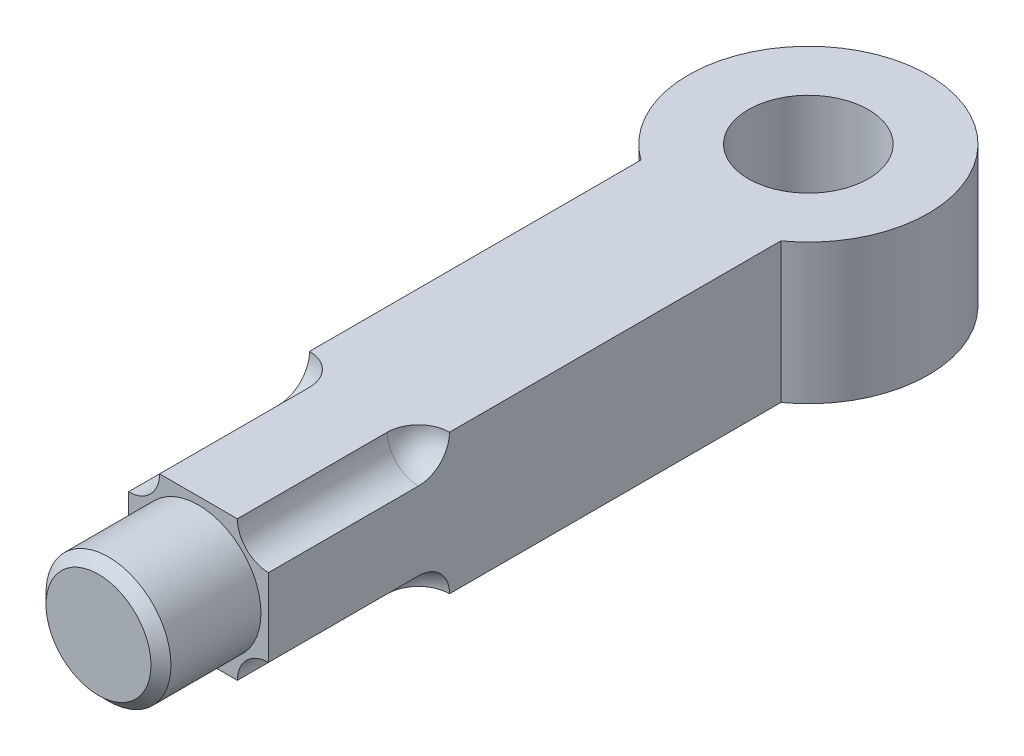
ISO-10303-21;
HEADER;
FILE_DESCRIPTION(('STEP AP214'),'2;1');
FILE_NAME('part.step','',(''),(''),'','','');
FILE_SCHEMA(('AUTOMOTIVE_DESIGN { 1 0 10303 214 1 1 1 1 }'));
ENDSEC;
DATA;
#1=APPLICATION_CONTEXT('core data for automotive mechanical design processes');
#2=APPLICATION_PROTOCOL_DEFINITION('international standard','automotive_design',2000,#1);
#3=PRODUCT_CONTEXT('',#1,'mechanical');
#4=PRODUCT('Part','Part','',(#3));
#5=PRODUCT_RELATED_PRODUCT_CATEGORY('part','',(#4));
#6=PRODUCT_DEFINITION_FORMATION('','',#4);
#7=PRODUCT_DEFINITION_CONTEXT('part definition',#1,'design');
#8=PRODUCT_DEFINITION('design','',#6,#7);
#9=PRODUCT_DEFINITION_SHAPE('','',#8);
#10=(LENGTH_UNIT() NAMED_UNIT(*) SI_UNIT(.MILLI.,.METRE.));
#11=(NAMED_UNIT(*) PLANE_ANGLE_UNIT() SI_UNIT($,.RADIAN.));
#12=(NAMED_UNIT(*) SI_UNIT($,.STERADIAN.) SOLID_ANGLE_UNIT());
#13=UNCERTAINTY_MEASURE_WITH_UNIT(LENGTH_MEASURE(1.E-05),#10,'distance_accuracy_value','');
#14=(GEOMETRIC_REPRESENTATION_CONTEXT(3) GLOBAL_UNCERTAINTY_ASSIGNED_CONTEXT((#13)) GLOBAL_UNIT_ASSIGNED_CONTEXT((#10,
#11,#12)) REPRESENTATION_CONTEXT('',''));
#15=CARTESIAN_POINT('',(0.,0.,0.));
#16=DIRECTION('',(0.,0.,1.));
#17=DIRECTION('',(1.,0.,0.));
#18=AXIS2_PLACEMENT_3D('',#15,#16,#17);
#19=CARTESIAN_POINT('',(0.,0.,122.));
#20=DIRECTION('',(0.,0.,1.));
#21=DIRECTION('',(1.,0.,0.));
#22=AXIS2_PLACEMENT_3D('',#19,#20,#21);
#23=PLANE('',#22);
#24=DIRECTION('',(0.,-1.,0.));
#25=VECTOR('',#24,1.);
#26=CARTESIAN_POINT('',(-14.,-14.,122.));
#27=LINE('',#26,#25);
#28=CARTESIAN_POINT('',(-14.,7.78,122.));
#29=VERTEX_POINT('',#28);
#30=CARTESIAN_POINT('',(-14.,-7.78,122.));
#31=VERTEX_POINT('',#30);
#32=EDGE_CURVE('E184',#29,#31,#27,.T.);
#33=ORIENTED_EDGE('',*,*,#32,.T.);
#34=CARTESIAN_POINT('',(-14.,-14.,122.));
#35=DIRECTION('',(0.,0.,-1.));
#36=DIRECTION('',(0.,-1.,0.));
#37=AXIS2_PLACEMENT_3D('',#34,#35,#36);
#38=CIRCLE('',#37,6.22000000000001);
#39=CARTESIAN_POINT('',(-7.77999999999999,-14.,122.));
#40=VERTEX_POINT('',#39);
#41=EDGE_CURVE('E129',#31,#40,#38,.T.);
#42=ORIENTED_EDGE('',*,*,#41,.T.);
#43=DIRECTION('',(1.,0.,0.));
#44=VECTOR('',#43,1.);
#45=CARTESIAN_POINT('',(14.,-14.,122.));
#46=LINE('',#45,#44);
#47=CARTESIAN_POINT('',(7.77999999999999,-14.,122.));
#48=VERTEX_POINT('',#47);
#49=EDGE_CURVE('E141',#40,#48,#46,.T.);
#50=ORIENTED_EDGE('',*,*,#49,.T.);
#51=CARTESIAN_POINT('',(14.,-14.,122.));
#52=DIRECTION('',(0.,0.,1.));
#53=DIRECTION('',(0.,-1.,0.));
#54=AXIS2_PLACEMENT_3D('',#51,#52,#53);
#55=CIRCLE('',#54,6.22000000000001);
#56=CARTESIAN_POINT('',(14.,-7.78,122.));
#57=VERTEX_POINT('',#56);
#58=EDGE_CURVE('E143',#57,#48,#55,.T.);
#59=ORIENTED_EDGE('',*,*,#58,.F.);
#60=DIRECTION('',(0.,1.,0.));
#61=VECTOR('',#60,1.);
#62=CARTESIAN_POINT('',(14.,-14.,122.));
#63=LINE('',#62,#61);
#64=CARTESIAN_POINT('',(14.,7.78,122.));
#65=VERTEX_POINT('',#64);
#66=EDGE_CURVE('E190',#57,#65,#63,.T.);
#67=ORIENTED_EDGE('',*,*,#66,.T.);
#68=CARTESIAN_POINT('',(14.,14.,122.));
#69=DIRECTION('',(0.,0.,-1.));
#70=DIRECTION('',(0.,1.,0.));
#71=AXIS2_PLACEMENT_3D('',#68,#69,#70);
#72=CIRCLE('',#71,6.22000000000001);
#73=CARTESIAN_POINT('',(7.77999999999999,14.,122.));
#74=VERTEX_POINT('',#73);
#75=EDGE_CURVE('E169',#65,#74,#72,.T.);
#76=ORIENTED_EDGE('',*,*,#75,.T.);
#77=DIRECTION('',(-1.,0.,0.));
#78=VECTOR('',#77,1.);
#79=CARTESIAN_POINT('',(14.,14.,122.));
#80=LINE('',#79,#78);
#81=CARTESIAN_POINT('',(-7.77999999999999,14.,122.));
#82=VERTEX_POINT('',#81);
#83=EDGE_CURVE('E188',#74,#82,#80,.T.);
#84=ORIENTED_EDGE('',*,*,#83,.T.);
#85=CARTESIAN_POINT('',(-14.,14.,122.));
#86=DIRECTION('',(0.,0.,1.));
#87=DIRECTION('',(0.,1.,0.));
#88=AXIS2_PLACEMENT_3D('',#85,#86,#87);
#89=CIRCLE('',#88,6.22000000000001);
#90=EDGE_CURVE('E158',#29,#82,#89,.T.);
#91=ORIENTED_EDGE('',*,*,#90,.F.);
#92=EDGE_LOOP('',(#33,#42,#50,#59,#67,#76,#84,#91));
#93=FACE_BOUND('',#92,.T.);
#94=CARTESIAN_POINT('',(0.,0.,122.));
#95=DIRECTION('',(0.,0.,1.));
#96=DIRECTION('',(1.,0.,0.));
#97=AXIS2_PLACEMENT_3D('',#94,#95,#96);
#98=CIRCLE('',#97,12.5);
#99=CARTESIAN_POINT('',(12.5,0.,122.));
#100=VERTEX_POINT('',#99);
#101=EDGE_CURVE('E136',#100,#100,#98,.T.);
#102=ORIENTED_EDGE('',*,*,#101,.F.);
#103=EDGE_LOOP('',(#102));
#104=FACE_BOUND('',#103,.T.);
#105=ADVANCED_FACE('F33',(#93,#104),#23,.T.);
#106=CARTESIAN_POINT('',(0.,-14.,0.));
#107=DIRECTION('',(0.,1.,0.));
#108=DIRECTION('',(0.,0.,1.));
#109=AXIS2_PLACEMENT_3D('',#106,#107,#108);
#110=PLANE('',#109);
#111=CARTESIAN_POINT('',(0.,-14.,0.));
#112=DIRECTION('',(0.,1.,0.));
#113=DIRECTION('',(0.,0.,1.));
#114=AXIS2_PLACEMENT_3D('',#111,#112,#113);
#115=CIRCLE('',#114,12.);
#116=CARTESIAN_POINT('',(0.,-14.,12.));
#117=VERTEX_POINT('',#116);
#118=EDGE_CURVE('E187',#117,#117,#115,.T.);
#119=ORIENTED_EDGE('',*,*,#118,.T.);
#120=EDGE_LOOP('',(#119));
#121=FACE_BOUND('',#120,.T.);
#122=DIRECTION('',(0.,0.,-1.));
#123=VECTOR('',#122,1.);
#124=CARTESIAN_POINT('',(-7.77999999999999,-14.,19.4935886896179));
#125=LINE('',#124,#123);
#126=CARTESIAN_POINT('',(-7.77999999999997,-14.,92.));
#127=VERTEX_POINT('',#126);
#128=EDGE_CURVE('E128',#127,#40,#125,.F.);
#129=ORIENTED_EDGE('',*,*,#128,.F.);
#130=CARTESIAN_POINT('',(-14.,-14.,92.0000000000001));
#131=DIRECTION('',(0.,1.,0.));
#132=DIRECTION('',(0.,0.,1.));
#133=AXIS2_PLACEMENT_3D('',#130,#131,#132);
#134=CIRCLE('',#133,6.22000000000006);
#135=CARTESIAN_POINT('',(-14.,-14.,85.78));
#136=VERTEX_POINT('',#135);
#137=EDGE_CURVE('E120',#136,#127,#134,.F.);
#138=ORIENTED_EDGE('',*,*,#137,.F.);
#139=DIRECTION('',(0.,0.,1.));
#140=VECTOR('',#139,1.);
#141=CARTESIAN_POINT('',(-14.,-14.,-500000.));
#142=LINE('',#141,#140);
#143=CARTESIAN_POINT('',(-14.,-14.,19.4935886896179));
#144=VERTEX_POINT('',#143);
#145=EDGE_CURVE('E183',#144,#136,#142,.T.);
#146=ORIENTED_EDGE('',*,*,#145,.F.);
#147=CARTESIAN_POINT('',(0.,-14.,0.));
#148=DIRECTION('',(0.,1.,0.));
#149=DIRECTION('',(0.,0.,1.));
#150=AXIS2_PLACEMENT_3D('',#147,#148,#149);
#151=CIRCLE('',#150,24.);
#152=CARTESIAN_POINT('',(14.,-14.,19.4935886896133));
#153=VERTEX_POINT('',#152);
#154=EDGE_CURVE('E207',#153,#144,#151,.T.);
#155=ORIENTED_EDGE('',*,*,#154,.F.);
#156=DIRECTION('',(0.,0.,1.));
#157=VECTOR('',#156,1.);
#158=CARTESIAN_POINT('',(14.,-14.,-500000.));
#159=LINE('',#158,#157);
#160=CARTESIAN_POINT('',(14.,-14.,85.78));
#161=VERTEX_POINT('',#160);
#162=EDGE_CURVE('E196',#153,#161,#159,.T.);
#163=ORIENTED_EDGE('',*,*,#162,.T.);
#164=CARTESIAN_POINT('',(14.,-14.,92.0000000000001));
#165=DIRECTION('',(0.,1.,0.));
#166=DIRECTION('',(0.,0.,1.));
#167=AXIS2_PLACEMENT_3D('',#164,#165,#166);
#168=CIRCLE('',#167,6.22000000000006);
#169=CARTESIAN_POINT('',(7.77999999999997,-14.,92.));
#170=VERTEX_POINT('',#169);
#171=EDGE_CURVE('E227',#170,#161,#168,.F.);
#172=ORIENTED_EDGE('',*,*,#171,.F.);
#173=DIRECTION('',(0.,0.,-1.));
#174=VECTOR('',#173,1.);
#175=CARTESIAN_POINT('',(7.77999999999999,-14.,19.4935886896179));
#176=LINE('',#175,#174);
#177=EDGE_CURVE('E229',#48,#170,#176,.T.);
#178=ORIENTED_EDGE('',*,*,#177,.F.);
#179=ORIENTED_EDGE('',*,*,#49,.F.);
#180=EDGE_LOOP('',(#129,#138,#146,#155,#163,#172,#178,#179));
#181=FACE_BOUND('',#180,.T.);
#182=ADVANCED_FACE('F139',(#121,#181),#110,.F.);
#183=CARTESIAN_POINT('',(-14.,-14.,-500000.));
#184=DIRECTION('',(-1.,0.,0.));
#185=DIRECTION('',(0.,0.,1.));
#186=AXIS2_PLACEMENT_3D('',#183,#184,#185);
#187=PLANE('',#186);
#188=CARTESIAN_POINT('',(-14.,-14.0000000000001,92.0000000000001));
#189=DIRECTION('',(-1.,0.,0.));
#190=DIRECTION('',(0.,0.,1.));
#191=AXIS2_PLACEMENT_3D('',#188,#189,#190);
#192=CIRCLE('',#191,6.22000000000006);
#193=CARTESIAN_POINT('',(-14.,-7.78,92.));
#194=VERTEX_POINT('',#193);
#195=EDGE_CURVE('E123',#136,#194,#192,.F.);
#196=ORIENTED_EDGE('',*,*,#195,.T.);
#197=DIRECTION('',(0.,0.,-1.));
#198=VECTOR('',#197,1.);
#199=CARTESIAN_POINT('',(-14.,-7.77999999999999,19.4935886896179));
#200=LINE('',#199,#198);
#201=EDGE_CURVE('E135',#194,#31,#200,.F.);
#202=ORIENTED_EDGE('',*,*,#201,.T.);
#203=ORIENTED_EDGE('',*,*,#32,.F.);
#204=DIRECTION('',(0.,0.,-1.));
#205=VECTOR('',#204,1.);
#206=CARTESIAN_POINT('',(-14.,7.77999999999999,19.4935886896179));
#207=LINE('',#206,#205);
#208=CARTESIAN_POINT('',(-14.,7.78,92.));
#209=VERTEX_POINT('',#208);
#210=EDGE_CURVE('E224',#29,#209,#207,.T.);
#211=ORIENTED_EDGE('',*,*,#210,.T.);
#212=CARTESIAN_POINT('',(-14.,14.0000000000001,92.0000000000001));
#213=DIRECTION('',(-1.,0.,0.));
#214=DIRECTION('',(0.,0.,1.));
#215=AXIS2_PLACEMENT_3D('',#212,#213,#214);
#216=CIRCLE('',#215,6.22000000000006);
#217=CARTESIAN_POINT('',(-14.,14.,85.78));
#218=VERTEX_POINT('',#217);
#219=EDGE_CURVE('E221',#209,#218,#216,.F.);
#220=ORIENTED_EDGE('',*,*,#219,.T.);
#221=DIRECTION('',(0.,0.,1.));
#222=VECTOR('',#221,1.);
#223=CARTESIAN_POINT('',(-14.,14.,-500000.));
#224=LINE('',#223,#222);
#225=CARTESIAN_POINT('',(-14.,14.,19.4935886896179));
#226=VERTEX_POINT('',#225);
#227=EDGE_CURVE('E191',#226,#218,#224,.T.);
#228=ORIENTED_EDGE('',*,*,#227,.F.);
#229=DIRECTION('',(0.,-1.,0.));
#230=VECTOR('',#229,1.);
#231=CARTESIAN_POINT('',(-14.,14.,19.4935886896179));
#232=LINE('',#231,#230);
#233=EDGE_CURVE('E178',#226,#144,#232,.T.);
#234=ORIENTED_EDGE('',*,*,#233,.T.);
#235=ORIENTED_EDGE('',*,*,#145,.T.);
#236=EDGE_LOOP('',(#196,#202,#203,#211,#220,#228,#234,#235));
#237=FACE_BOUND('',#236,.T.);
#238=ADVANCED_FACE('F251',(#237),#187,.T.);
#239=CARTESIAN_POINT('',(14.,-14.,-500000.));
#240=DIRECTION('',(1.,0.,0.));
#241=DIRECTION('',(0.,0.,-1.));
#242=AXIS2_PLACEMENT_3D('',#239,#240,#241);
#243=PLANE('',#242);
#244=ORIENTED_EDGE('',*,*,#66,.F.);
#245=DIRECTION('',(0.,0.,-1.));
#246=VECTOR('',#245,1.);
#247=CARTESIAN_POINT('',(14.,-7.77999999999999,19.4935886896179));
#248=LINE('',#247,#246);
#249=CARTESIAN_POINT('',(14.,-7.78,92.));
#250=VERTEX_POINT('',#249);
#251=EDGE_CURVE('E152',#57,#250,#248,.T.);
#252=ORIENTED_EDGE('',*,*,#251,.T.);
#253=CARTESIAN_POINT('',(14.,-14.0000000000001,92.0000000000001));
#254=DIRECTION('',(1.,0.,0.));
#255=DIRECTION('',(0.,0.,-1.));
#256=AXIS2_PLACEMENT_3D('',#253,#254,#255);
#257=CIRCLE('',#256,6.22000000000006);
#258=EDGE_CURVE('E149',#250,#161,#257,.F.);
#259=ORIENTED_EDGE('',*,*,#258,.T.);
#260=ORIENTED_EDGE('',*,*,#162,.F.);
#261=DIRECTION('',(0.,-1.,0.));
#262=VECTOR('',#261,1.);
#263=CARTESIAN_POINT('',(14.,14.,19.4935886896179));
#264=LINE('',#263,#262);
#265=CARTESIAN_POINT('',(14.,14.,19.4935886896179));
#266=VERTEX_POINT('',#265);
#267=EDGE_CURVE('E180',#153,#266,#264,.F.);
#268=ORIENTED_EDGE('',*,*,#267,.T.);
#269=DIRECTION('',(0.,0.,1.));
#270=VECTOR('',#269,1.);
#271=CARTESIAN_POINT('',(14.,14.,-500000.));
#272=LINE('',#271,#270);
#273=CARTESIAN_POINT('',(14.,14.,85.78));
#274=VERTEX_POINT('',#273);
#275=EDGE_CURVE('E199',#266,#274,#272,.T.);
#276=ORIENTED_EDGE('',*,*,#275,.T.);
#277=CARTESIAN_POINT('',(14.,14.0000000000001,92.0000000000001));
#278=DIRECTION('',(1.,0.,0.));
#279=DIRECTION('',(0.,0.,-1.));
#280=AXIS2_PLACEMENT_3D('',#277,#278,#279);
#281=CIRCLE('',#280,6.22000000000006);
#282=CARTESIAN_POINT('',(14.,7.78,92.));
#283=VERTEX_POINT('',#282);
#284=EDGE_CURVE('E213',#274,#283,#281,.F.);
#285=ORIENTED_EDGE('',*,*,#284,.T.);
#286=DIRECTION('',(0.,0.,-1.));
#287=VECTOR('',#286,1.);
#288=CARTESIAN_POINT('',(14.,7.77999999999999,19.4935886896179));
#289=LINE('',#288,#287);
#290=EDGE_CURVE('E218',#283,#65,#289,.F.);
#291=ORIENTED_EDGE('',*,*,#290,.T.);
#292=EDGE_LOOP('',(#244,#252,#259,#260,#268,#276,#285,#291));
#293=FACE_BOUND('',#292,.T.);
#294=ADVANCED_FACE('F261',(#293),#243,.T.);
#295=CARTESIAN_POINT('',(0.,14.,0.));
#296=DIRECTION('',(0.,1.,0.));
#297=DIRECTION('',(0.,0.,1.));
#298=AXIS2_PLACEMENT_3D('',#295,#296,#297);
#299=PLANE('',#298);
#300=CARTESIAN_POINT('',(0.,14.,0.));
#301=DIRECTION('',(0.,1.,0.));
#302=DIRECTION('',(0.,0.,1.));
#303=AXIS2_PLACEMENT_3D('',#300,#301,#302);
#304=CIRCLE('',#303,12.);
#305=CARTESIAN_POINT('',(0.,14.,12.));
#306=VERTEX_POINT('',#305);
#307=EDGE_CURVE('E204',#306,#306,#304,.T.);
#308=ORIENTED_EDGE('',*,*,#307,.F.);
#309=EDGE_LOOP('',(#308));
#310=FACE_BOUND('',#309,.T.);
#311=CARTESIAN_POINT('',(-14.,14.,92.0000000000001));
#312=DIRECTION('',(0.,1.,0.));
#313=DIRECTION('',(0.,0.,1.));
#314=AXIS2_PLACEMENT_3D('',#311,#312,#313);
#315=CIRCLE('',#314,6.22000000000006);
#316=CARTESIAN_POINT('',(-7.77999999999997,14.,92.));
#317=VERTEX_POINT('',#316);
#318=EDGE_CURVE('E160',#218,#317,#315,.F.);
#319=ORIENTED_EDGE('',*,*,#318,.T.);
#320=DIRECTION('',(0.,0.,-1.));
#321=VECTOR('',#320,1.);
#322=CARTESIAN_POINT('',(-7.77999999999999,14.,19.4935886896179));
#323=LINE('',#322,#321);
#324=EDGE_CURVE('E163',#317,#82,#323,.F.);
#325=ORIENTED_EDGE('',*,*,#324,.T.);
#326=ORIENTED_EDGE('',*,*,#83,.F.);
#327=DIRECTION('',(0.,0.,-1.));
#328=VECTOR('',#327,1.);
#329=CARTESIAN_POINT('',(7.77999999999999,14.,19.4935886896179));
#330=LINE('',#329,#328);
#331=CARTESIAN_POINT('',(7.77999999999997,14.,92.));
#332=VERTEX_POINT('',#331);
#333=EDGE_CURVE('E175',#74,#332,#330,.T.);
#334=ORIENTED_EDGE('',*,*,#333,.T.);
#335=CARTESIAN_POINT('',(14.,14.,92.0000000000001));
#336=DIRECTION('',(0.,1.,0.));
#337=DIRECTION('',(0.,0.,1.));
#338=AXIS2_PLACEMENT_3D('',#335,#336,#337);
#339=CIRCLE('',#338,6.22000000000006);
#340=EDGE_CURVE('E172',#332,#274,#339,.F.);
#341=ORIENTED_EDGE('',*,*,#340,.T.);
#342=ORIENTED_EDGE('',*,*,#275,.F.);
#343=CARTESIAN_POINT('',(0.,14.,0.));
#344=DIRECTION('',(0.,1.,0.));
#345=DIRECTION('',(0.,0.,1.));
#346=AXIS2_PLACEMENT_3D('',#343,#344,#345);
#347=CIRCLE('',#346,24.);
#348=EDGE_CURVE('E210',#266,#226,#347,.T.);
#349=ORIENTED_EDGE('',*,*,#348,.T.);
#350=ORIENTED_EDGE('',*,*,#227,.T.);
#351=EDGE_LOOP('',(#319,#325,#326,#334,#341,#342,#349,#350));
#352=FACE_BOUND('',#351,.T.);
#353=ADVANCED_FACE('F265',(#310,#352),#299,.T.);
#354=CARTESIAN_POINT('',(0.,14.,0.));
#355=DIRECTION('',(0.,-1.,0.));
#356=DIRECTION('',(0.,0.,-1.));
#357=AXIS2_PLACEMENT_3D('',#354,#355,#356);
#358=CYLINDRICAL_SURFACE('',#357,24.);
#359=ORIENTED_EDGE('',*,*,#154,.T.);
#360=ORIENTED_EDGE('',*,*,#233,.F.);
#361=ORIENTED_EDGE('',*,*,#348,.F.);
#362=ORIENTED_EDGE('',*,*,#267,.F.);
#363=EDGE_LOOP('',(#359,#360,#361,#362));
#364=FACE_BOUND('',#363,.T.);
#365=ADVANCED_FACE('F270',(#364),#358,.T.);
#366=CARTESIAN_POINT('',(0.,14.,0.));
#367=DIRECTION('',(0.,-1.,0.));
#368=DIRECTION('',(0.,0.,-1.));
#369=AXIS2_PLACEMENT_3D('',#366,#367,#368);
#370=CYLINDRICAL_SURFACE('',#369,12.);
#371=ORIENTED_EDGE('',*,*,#307,.T.);
#372=EDGE_LOOP('',(#371));
#373=FACE_BOUND('',#372,.T.);
#374=ORIENTED_EDGE('',*,*,#118,.F.);
#375=EDGE_LOOP('',(#374));
#376=FACE_BOUND('',#375,.T.);
#377=ADVANCED_FACE('F267',(#373,#376),#370,.F.);
#378=CARTESIAN_POINT('',(14.,14.,19.4935886896179));
#379=DIRECTION('',(0.,0.,-1.));
#380=DIRECTION('',(0.,1.,0.));
#381=AXIS2_PLACEMENT_3D('',#378,#379,#380);
#382=CYLINDRICAL_SURFACE('',#381,6.22000000000001);
#383=ORIENTED_EDGE('',*,*,#75,.F.);
#384=ORIENTED_EDGE('',*,*,#290,.F.);
#385=CARTESIAN_POINT('',(14.,14.,92.));
#386=DIRECTION('',(0.,0.,-1.));
#387=DIRECTION('',(0.,1.,0.));
#388=AXIS2_PLACEMENT_3D('',#385,#386,#387);
#389=CIRCLE('',#388,6.22000000000001);
#390=EDGE_CURVE('E166',#283,#332,#389,.T.);
#391=ORIENTED_EDGE('',*,*,#390,.T.);
#392=ORIENTED_EDGE('',*,*,#333,.F.);
#393=EDGE_LOOP('',(#383,#384,#391,#392));
#394=FACE_BOUND('',#393,.T.);
#395=ADVANCED_FACE('F257',(#394),#382,.F.);
#396=CARTESIAN_POINT('',(14.,14.0000000000001,92.0000000000001));
#397=DIRECTION('',(0.,0.,-1.));
#398=DIRECTION('',(0.,-1.,0.));
#399=AXIS2_PLACEMENT_3D('',#396,#397,#398);
#400=SPHERICAL_SURFACE('',#399,6.22000000000006);
#401=ORIENTED_EDGE('',*,*,#390,.F.);
#402=ORIENTED_EDGE('',*,*,#284,.F.);
#403=ORIENTED_EDGE('',*,*,#340,.F.);
#404=EDGE_LOOP('',(#401,#402,#403));
#405=FACE_BOUND('',#404,.T.);
#406=ADVANCED_FACE('F306',(#405),#400,.F.);
#407=CARTESIAN_POINT('',(-14.,14.,19.4935886896179));
#408=DIRECTION('',(0.,0.,-1.));
#409=DIRECTION('',(0.,1.,0.));
#410=AXIS2_PLACEMENT_3D('',#407,#408,#409);
#411=CYLINDRICAL_SURFACE('',#410,6.22000000000001);
#412=CARTESIAN_POINT('',(-14.,14.,92.));
#413=DIRECTION('',(0.,0.,1.));
#414=DIRECTION('',(0.,1.,0.));
#415=AXIS2_PLACEMENT_3D('',#412,#413,#414);
#416=CIRCLE('',#415,6.22000000000001);
#417=EDGE_CURVE('E155',#209,#317,#416,.T.);
#418=ORIENTED_EDGE('',*,*,#417,.F.);
#419=ORIENTED_EDGE('',*,*,#210,.F.);
#420=ORIENTED_EDGE('',*,*,#90,.T.);
#421=ORIENTED_EDGE('',*,*,#324,.F.);
#422=EDGE_LOOP('',(#418,#419,#420,#421));
#423=FACE_BOUND('',#422,.T.);
#424=ADVANCED_FACE('F296',(#423),#411,.F.);
#425=CARTESIAN_POINT('',(-14.,14.0000000000001,92.0000000000001));
#426=DIRECTION('',(0.,0.,-1.));
#427=DIRECTION('',(0.,-1.,0.));
#428=AXIS2_PLACEMENT_3D('',#425,#426,#427);
#429=SPHERICAL_SURFACE('',#428,6.22000000000006);
#430=ORIENTED_EDGE('',*,*,#219,.F.);
#431=ORIENTED_EDGE('',*,*,#417,.T.);
#432=ORIENTED_EDGE('',*,*,#318,.F.);
#433=EDGE_LOOP('',(#430,#431,#432));
#434=FACE_BOUND('',#433,.T.);
#435=ADVANCED_FACE('F298',(#434),#429,.F.);
#436=CARTESIAN_POINT('',(14.,-14.,19.4935886896179));
#437=DIRECTION('',(0.,0.,-1.));
#438=DIRECTION('',(0.,-1.,0.));
#439=AXIS2_PLACEMENT_3D('',#436,#437,#438);
#440=CYLINDRICAL_SURFACE('',#439,6.22000000000001);
#441=ORIENTED_EDGE('',*,*,#58,.T.);
#442=ORIENTED_EDGE('',*,*,#177,.T.);
#443=CARTESIAN_POINT('',(14.,-14.,92.));
#444=DIRECTION('',(0.,0.,1.));
#445=DIRECTION('',(0.,-1.,0.));
#446=AXIS2_PLACEMENT_3D('',#443,#444,#445);
#447=CIRCLE('',#446,6.22000000000001);
#448=EDGE_CURVE('E56',#250,#170,#447,.T.);
#449=ORIENTED_EDGE('',*,*,#448,.F.);
#450=ORIENTED_EDGE('',*,*,#251,.F.);
#451=EDGE_LOOP('',(#441,#442,#449,#450));
#452=FACE_BOUND('',#451,.T.);
#453=ADVANCED_FACE('F287',(#452),#440,.F.);
#454=CARTESIAN_POINT('',(14.,-14.0000000000001,92.0000000000001));
#455=DIRECTION('',(0.,0.,-1.));
#456=DIRECTION('',(0.,1.,0.));
#457=AXIS2_PLACEMENT_3D('',#454,#455,#456);
#458=SPHERICAL_SURFACE('',#457,6.22000000000006);
#459=ORIENTED_EDGE('',*,*,#448,.T.);
#460=ORIENTED_EDGE('',*,*,#171,.T.);
#461=ORIENTED_EDGE('',*,*,#258,.F.);
#462=EDGE_LOOP('',(#459,#460,#461));
#463=FACE_BOUND('',#462,.T.);
#464=ADVANCED_FACE('F285',(#463),#458,.F.);
#465=CARTESIAN_POINT('',(-14.,-14.,19.4935886896179));
#466=DIRECTION('',(0.,0.,-1.));
#467=DIRECTION('',(0.,-1.,0.));
#468=AXIS2_PLACEMENT_3D('',#465,#466,#467);
#469=CYLINDRICAL_SURFACE('',#468,6.22000000000001);
#470=ORIENTED_EDGE('',*,*,#128,.T.);
#471=ORIENTED_EDGE('',*,*,#41,.F.);
#472=ORIENTED_EDGE('',*,*,#201,.F.);
#473=CARTESIAN_POINT('',(-14.,-14.,92.));
#474=DIRECTION('',(0.,0.,-1.));
#475=DIRECTION('',(0.,-1.,0.));
#476=AXIS2_PLACEMENT_3D('',#473,#474,#475);
#477=CIRCLE('',#476,6.22000000000001);
#478=EDGE_CURVE('E48',#194,#127,#477,.T.);
#479=ORIENTED_EDGE('',*,*,#478,.T.);
#480=EDGE_LOOP('',(#470,#471,#472,#479));
#481=FACE_BOUND('',#480,.T.);
#482=ADVANCED_FACE('F132',(#481),#469,.F.);
#483=CARTESIAN_POINT('',(-14.,-14.0000000000001,92.0000000000001));
#484=DIRECTION('',(0.,0.,-1.));
#485=DIRECTION('',(0.,1.,0.));
#486=AXIS2_PLACEMENT_3D('',#483,#484,#485);
#487=SPHERICAL_SURFACE('',#486,6.22000000000006);
#488=ORIENTED_EDGE('',*,*,#137,.T.);
#489=ORIENTED_EDGE('',*,*,#478,.F.);
#490=ORIENTED_EDGE('',*,*,#195,.F.);
#491=EDGE_LOOP('',(#488,#489,#490));
#492=FACE_BOUND('',#491,.T.);
#493=ADVANCED_FACE('F121',(#492),#487,.F.);
#494=CARTESIAN_POINT('',(0.,0.,142.));
#495=DIRECTION('',(0.,0.,-1.));
#496=DIRECTION('',(-1.,0.,0.));
#497=AXIS2_PLACEMENT_3D('',#494,#495,#496);
#498=CYLINDRICAL_SURFACE('',#497,12.5);
#499=CARTESIAN_POINT('',(0.,0.,140.));
#500=DIRECTION('',(0.,0.,1.));
#501=DIRECTION('',(1.,0.,0.));
#502=AXIS2_PLACEMENT_3D('',#499,#500,#501);
#503=CIRCLE('',#502,12.5);
#504=CARTESIAN_POINT('',(12.5,0.,140.));
#505=VERTEX_POINT('',#504);
#506=EDGE_CURVE('E11',#505,#505,#503,.F.);
#507=ORIENTED_EDGE('',*,*,#506,.T.);
#508=EDGE_LOOP('',(#507));
#509=FACE_BOUND('',#508,.T.);
#510=ORIENTED_EDGE('',*,*,#101,.T.);
#511=EDGE_LOOP('',(#510));
#512=FACE_BOUND('',#511,.T.);
#513=ADVANCED_FACE('F242',(#509,#512),#498,.T.);
#514=CARTESIAN_POINT('',(0.,0.,142.));
#515=DIRECTION('',(0.,0.,1.));
#516=DIRECTION('',(1.,0.,0.));
#517=AXIS2_PLACEMENT_3D('',#514,#515,#516);
#518=PLANE('',#517);
#519=CARTESIAN_POINT('',(0.,0.,142.));
#520=DIRECTION('',(0.,0.,1.));
#521=DIRECTION('',(1.,0.,0.));
#522=AXIS2_PLACEMENT_3D('',#519,#520,#521);
#523=CIRCLE('',#522,10.5);
#524=CARTESIAN_POINT('',(10.5,0.,142.));
#525=VERTEX_POINT('',#524);
#526=EDGE_CURVE('E41',#525,#525,#523,.T.);
#527=ORIENTED_EDGE('',*,*,#526,.T.);
#528=EDGE_LOOP('',(#527));
#529=FACE_BOUND('',#528,.T.);
#530=ADVANCED_FACE('F235',(#529),#518,.T.);
#531=CARTESIAN_POINT('',(0.,0.,142.));
#532=DIRECTION('',(0.,0.,-1.));
#533=DIRECTION('',(-1.,0.,0.));
#534=AXIS2_PLACEMENT_3D('',#531,#532,#533);
#535=CONICAL_SURFACE('',#534,10.5,0.785398163397446);
#536=ORIENTED_EDGE('',*,*,#506,.F.);
#537=EDGE_LOOP('',(#536));
#538=FACE_BOUND('',#537,.T.);
#539=ORIENTED_EDGE('',*,*,#526,.F.);
#540=EDGE_LOOP('',(#539));
#541=FACE_BOUND('',#540,.T.);
#542=ADVANCED_FACE('F35',(#538,#541),#535,.T.);
#543=CLOSED_SHELL('',(#105,#182,#238,#294,#353,#365,#377,#395,#406,#424,#435,#453,#464,#482,
#493,#513,#530,#542));
#544=MANIFOLD_SOLID_BREP('B2',#543);
#545=ADVANCED_BREP_SHAPE_REPRESENTATION('',(#18,#544),#14);
#546=SHAPE_DEFINITION_REPRESENTATION(#9,#545);
ENDSEC;
END-ISO-10303-21;
